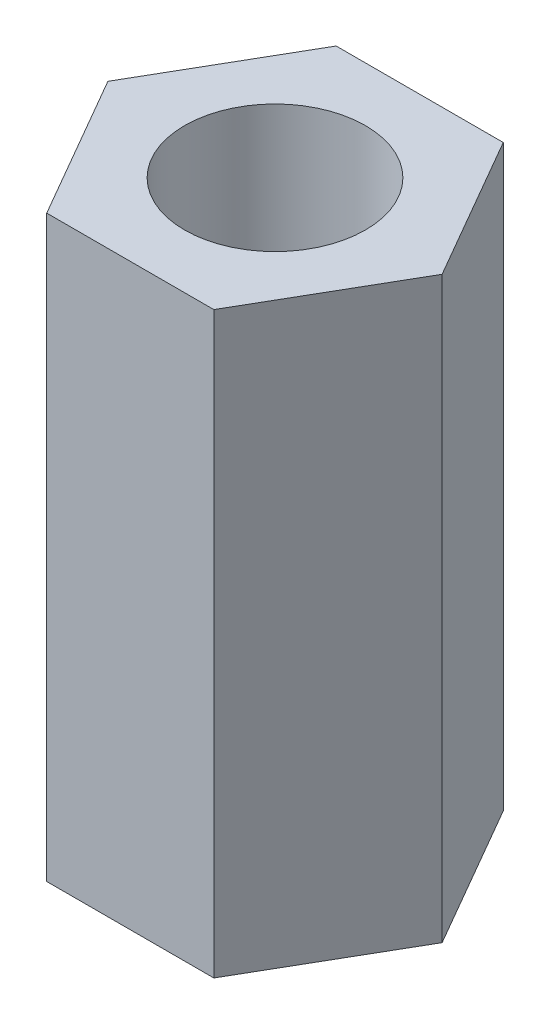
ISO-10303-21;
HEADER;
FILE_DESCRIPTION(('STEP AP214'),'2;1');
FILE_NAME('part.step','',(''),(''),'','','');
FILE_SCHEMA(('AUTOMOTIVE_DESIGN { 1 0 10303 214 1 1 1 1 }'));
ENDSEC;
DATA;
#1=APPLICATION_CONTEXT('core data for automotive mechanical design processes');
#2=APPLICATION_PROTOCOL_DEFINITION('international standard','automotive_design',2000,#1);
#3=PRODUCT_CONTEXT('',#1,'mechanical');
#4=PRODUCT('Part','Part','',(#3));
#5=PRODUCT_RELATED_PRODUCT_CATEGORY('part','',(#4));
#6=PRODUCT_DEFINITION_FORMATION('','',#4);
#7=PRODUCT_DEFINITION_CONTEXT('part definition',#1,'design');
#8=PRODUCT_DEFINITION('design','',#6,#7);
#9=PRODUCT_DEFINITION_SHAPE('','',#8);
#10=(LENGTH_UNIT() NAMED_UNIT(*) SI_UNIT(.MILLI.,.METRE.));
#11=(NAMED_UNIT(*) PLANE_ANGLE_UNIT() SI_UNIT($,.RADIAN.));
#12=(NAMED_UNIT(*) SI_UNIT($,.STERADIAN.) SOLID_ANGLE_UNIT());
#13=UNCERTAINTY_MEASURE_WITH_UNIT(LENGTH_MEASURE(1.E-05),#10,'distance_accuracy_value','');
#14=(GEOMETRIC_REPRESENTATION_CONTEXT(3) GLOBAL_UNCERTAINTY_ASSIGNED_CONTEXT((#13)) GLOBAL_UNIT_ASSIGNED_CONTEXT((#10,
#11,#12)) REPRESENTATION_CONTEXT('',''));
#15=CARTESIAN_POINT('',(0.,0.,0.));
#16=DIRECTION('',(0.,0.,1.));
#17=DIRECTION('',(1.,0.,0.));
#18=AXIS2_PLACEMENT_3D('',#15,#16,#17);
#19=CARTESIAN_POINT('',(0.,12.7,0.));
#20=DIRECTION('',(0.,1.,0.));
#21=DIRECTION('',(0.,0.,1.));
#22=AXIS2_PLACEMENT_3D('',#19,#20,#21);
#23=PLANE('',#22);
#24=DIRECTION('',(1.,0.,0.));
#25=VECTOR('',#24,1.);
#26=CARTESIAN_POINT('',(-1.83308710467706,12.7,3.175));
#27=LINE('',#26,#25);
#28=CARTESIAN_POINT('',(-1.83308710467706,12.7,3.175));
#29=VERTEX_POINT('',#28);
#30=CARTESIAN_POINT('',(1.83308710467706,12.7,3.175));
#31=VERTEX_POINT('',#30);
#32=EDGE_CURVE('E129',#29,#31,#27,.T.);
#33=ORIENTED_EDGE('',*,*,#32,.T.);
#34=DIRECTION('',(0.5,0.,-0.866025403784439));
#35=VECTOR('',#34,1.);
#36=CARTESIAN_POINT('',(1.83308710467706,12.7,3.175));
#37=LINE('',#36,#35);
#38=CARTESIAN_POINT('',(3.66617420935412,12.7,0.));
#39=VERTEX_POINT('',#38);
#40=EDGE_CURVE('E87',#31,#39,#37,.T.);
#41=ORIENTED_EDGE('',*,*,#40,.T.);
#42=DIRECTION('',(-0.5,0.,-0.866025403784439));
#43=VECTOR('',#42,1.);
#44=CARTESIAN_POINT('',(3.66617420935412,12.7,0.));
#45=LINE('',#44,#43);
#46=CARTESIAN_POINT('',(1.83308710467706,12.7,-3.175));
#47=VERTEX_POINT('',#46);
#48=EDGE_CURVE('E100',#39,#47,#45,.T.);
#49=ORIENTED_EDGE('',*,*,#48,.T.);
#50=DIRECTION('',(-1.,0.,0.));
#51=VECTOR('',#50,1.);
#52=CARTESIAN_POINT('',(1.83308710467706,12.7,-3.175));
#53=LINE('',#52,#51);
#54=CARTESIAN_POINT('',(-1.83308710467706,12.7,-3.175));
#55=VERTEX_POINT('',#54);
#56=EDGE_CURVE('E94',#47,#55,#53,.T.);
#57=ORIENTED_EDGE('',*,*,#56,.T.);
#58=DIRECTION('',(-0.5,0.,0.866025403784439));
#59=VECTOR('',#58,1.);
#60=CARTESIAN_POINT('',(-1.83308710467706,12.7,-3.175));
#61=LINE('',#60,#59);
#62=CARTESIAN_POINT('',(-3.66617420935412,12.7,0.));
#63=VERTEX_POINT('',#62);
#64=EDGE_CURVE('E98',#55,#63,#61,.T.);
#65=ORIENTED_EDGE('',*,*,#64,.T.);
#66=DIRECTION('',(0.5,0.,0.866025403784439));
#67=VECTOR('',#66,1.);
#68=CARTESIAN_POINT('',(-3.66617420935412,12.7,0.));
#69=LINE('',#68,#67);
#70=EDGE_CURVE('E50',#63,#29,#69,.T.);
#71=ORIENTED_EDGE('',*,*,#70,.T.);
#72=EDGE_LOOP('',(#33,#41,#49,#57,#65,#71));
#73=FACE_BOUND('',#72,.T.);
#74=CARTESIAN_POINT('',(0.,12.7,0.));
#75=DIRECTION('',(0.,1.,0.));
#76=DIRECTION('',(0.,0.,1.));
#77=AXIS2_PLACEMENT_3D('',#74,#75,#76);
#78=CIRCLE('',#77,1.984375);
#79=CARTESIAN_POINT('',(0.,12.7,1.984375));
#80=VERTEX_POINT('',#79);
#81=EDGE_CURVE('E122',#80,#80,#78,.T.);
#82=ORIENTED_EDGE('',*,*,#81,.F.);
#83=EDGE_LOOP('',(#82));
#84=FACE_BOUND('',#83,.T.);
#85=ADVANCED_FACE('F33',(#73,#84),#23,.T.);
#86=CARTESIAN_POINT('',(0.,0.,0.));
#87=DIRECTION('',(0.,1.,0.));
#88=DIRECTION('',(0.,0.,1.));
#89=AXIS2_PLACEMENT_3D('',#86,#87,#88);
#90=PLANE('',#89);
#91=DIRECTION('',(1.,0.,0.));
#92=VECTOR('',#91,1.);
#93=CARTESIAN_POINT('',(-1.83308710467706,0.,3.175));
#94=LINE('',#93,#92);
#95=CARTESIAN_POINT('',(-1.83308710467706,0.,3.175));
#96=VERTEX_POINT('',#95);
#97=CARTESIAN_POINT('',(1.83308710467706,0.,3.175));
#98=VERTEX_POINT('',#97);
#99=EDGE_CURVE('E118',#96,#98,#94,.T.);
#100=ORIENTED_EDGE('',*,*,#99,.F.);
#101=DIRECTION('',(0.5,0.,0.866025403784439));
#102=VECTOR('',#101,1.);
#103=CARTESIAN_POINT('',(-3.66617420935412,0.,0.));
#104=LINE('',#103,#102);
#105=CARTESIAN_POINT('',(-3.66617420935412,0.,0.));
#106=VERTEX_POINT('',#105);
#107=EDGE_CURVE('E79',#106,#96,#104,.T.);
#108=ORIENTED_EDGE('',*,*,#107,.F.);
#109=DIRECTION('',(-0.5,0.,0.866025403784439));
#110=VECTOR('',#109,1.);
#111=CARTESIAN_POINT('',(-1.83308710467706,0.,-3.175));
#112=LINE('',#111,#110);
#113=CARTESIAN_POINT('',(-1.83308710467706,0.,-3.175));
#114=VERTEX_POINT('',#113);
#115=EDGE_CURVE('E73',#114,#106,#112,.T.);
#116=ORIENTED_EDGE('',*,*,#115,.F.);
#117=DIRECTION('',(-1.,0.,0.));
#118=VECTOR('',#117,1.);
#119=CARTESIAN_POINT('',(1.83308710467706,0.,-3.175));
#120=LINE('',#119,#118);
#121=CARTESIAN_POINT('',(1.83308710467706,0.,-3.175));
#122=VERTEX_POINT('',#121);
#123=EDGE_CURVE('E108',#122,#114,#120,.T.);
#124=ORIENTED_EDGE('',*,*,#123,.F.);
#125=DIRECTION('',(-0.5,0.,-0.866025403784439));
#126=VECTOR('',#125,1.);
#127=CARTESIAN_POINT('',(3.66617420935412,0.,0.));
#128=LINE('',#127,#126);
#129=CARTESIAN_POINT('',(3.66617420935412,0.,0.));
#130=VERTEX_POINT('',#129);
#131=EDGE_CURVE('E124',#130,#122,#128,.T.);
#132=ORIENTED_EDGE('',*,*,#131,.F.);
#133=DIRECTION('',(0.5,0.,-0.866025403784439));
#134=VECTOR('',#133,1.);
#135=CARTESIAN_POINT('',(1.83308710467706,0.,3.175));
#136=LINE('',#135,#134);
#137=EDGE_CURVE('E121',#98,#130,#136,.T.);
#138=ORIENTED_EDGE('',*,*,#137,.F.);
#139=EDGE_LOOP('',(#100,#108,#116,#124,#132,#138));
#140=FACE_BOUND('',#139,.T.);
#141=CARTESIAN_POINT('',(0.,0.,0.));
#142=DIRECTION('',(0.,1.,0.));
#143=DIRECTION('',(0.,0.,1.));
#144=AXIS2_PLACEMENT_3D('',#141,#142,#143);
#145=CIRCLE('',#144,1.984375);
#146=CARTESIAN_POINT('',(0.,0.,1.984375));
#147=VERTEX_POINT('',#146);
#148=EDGE_CURVE('E222',#147,#147,#145,.T.);
#149=ORIENTED_EDGE('',*,*,#148,.T.);
#150=EDGE_LOOP('',(#149));
#151=FACE_BOUND('',#150,.T.);
#152=ADVANCED_FACE('F138',(#140,#151),#90,.F.);
#153=CARTESIAN_POINT('',(-1.83308710467706,12.7,3.175));
#154=DIRECTION('',(0.,0.,-1.));
#155=DIRECTION('',(-1.,0.,0.));
#156=AXIS2_PLACEMENT_3D('',#153,#154,#155);
#157=PLANE('',#156);
#158=ORIENTED_EDGE('',*,*,#99,.T.);
#159=DIRECTION('',(0.,-1.,0.));
#160=VECTOR('',#159,1.);
#161=CARTESIAN_POINT('',(1.83308710467706,12.7,3.175));
#162=LINE('',#161,#160);
#163=EDGE_CURVE('E11',#31,#98,#162,.T.);
#164=ORIENTED_EDGE('',*,*,#163,.F.);
#165=ORIENTED_EDGE('',*,*,#32,.F.);
#166=DIRECTION('',(0.,-1.,0.));
#167=VECTOR('',#166,1.);
#168=CARTESIAN_POINT('',(-1.83308710467706,12.7,3.175));
#169=LINE('',#168,#167);
#170=EDGE_CURVE('E114',#29,#96,#169,.T.);
#171=ORIENTED_EDGE('',*,*,#170,.T.);
#172=EDGE_LOOP('',(#158,#164,#165,#171));
#173=FACE_BOUND('',#172,.T.);
#174=ADVANCED_FACE('F35',(#173),#157,.F.);
#175=CARTESIAN_POINT('',(1.83308710467706,12.7,3.175));
#176=DIRECTION('',(-0.866025403784439,0.,-0.5));
#177=DIRECTION('',(-0.5,0.,0.866025403784439));
#178=AXIS2_PLACEMENT_3D('',#175,#176,#177);
#179=PLANE('',#178);
#180=ORIENTED_EDGE('',*,*,#137,.T.);
#181=DIRECTION('',(0.,-1.,0.));
#182=VECTOR('',#181,1.);
#183=CARTESIAN_POINT('',(3.66617420935412,12.7,0.));
#184=LINE('',#183,#182);
#185=EDGE_CURVE('E42',#39,#130,#184,.T.);
#186=ORIENTED_EDGE('',*,*,#185,.F.);
#187=ORIENTED_EDGE('',*,*,#40,.F.);
#188=ORIENTED_EDGE('',*,*,#163,.T.);
#189=EDGE_LOOP('',(#180,#186,#187,#188));
#190=FACE_BOUND('',#189,.T.);
#191=ADVANCED_FACE('F163',(#190),#179,.F.);
#192=CARTESIAN_POINT('',(3.66617420935412,12.7,0.));
#193=DIRECTION('',(-0.866025403784439,0.,0.5));
#194=DIRECTION('',(0.5,0.,0.866025403784439));
#195=AXIS2_PLACEMENT_3D('',#192,#193,#194);
#196=PLANE('',#195);
#197=ORIENTED_EDGE('',*,*,#131,.T.);
#198=DIRECTION('',(0.,-1.,0.));
#199=VECTOR('',#198,1.);
#200=CARTESIAN_POINT('',(1.83308710467706,12.7,-3.175));
#201=LINE('',#200,#199);
#202=EDGE_CURVE('E109',#47,#122,#201,.T.);
#203=ORIENTED_EDGE('',*,*,#202,.F.);
#204=ORIENTED_EDGE('',*,*,#48,.F.);
#205=ORIENTED_EDGE('',*,*,#185,.T.);
#206=EDGE_LOOP('',(#197,#203,#204,#205));
#207=FACE_BOUND('',#206,.T.);
#208=ADVANCED_FACE('F135',(#207),#196,.F.);
#209=CARTESIAN_POINT('',(1.83308710467706,12.7,-3.175));
#210=DIRECTION('',(0.,0.,1.));
#211=DIRECTION('',(1.,0.,0.));
#212=AXIS2_PLACEMENT_3D('',#209,#210,#211);
#213=PLANE('',#212);
#214=ORIENTED_EDGE('',*,*,#123,.T.);
#215=DIRECTION('',(0.,-1.,0.));
#216=VECTOR('',#215,1.);
#217=CARTESIAN_POINT('',(-1.83308710467706,12.7,-3.175));
#218=LINE('',#217,#216);
#219=EDGE_CURVE('E105',#55,#114,#218,.T.);
#220=ORIENTED_EDGE('',*,*,#219,.F.);
#221=ORIENTED_EDGE('',*,*,#56,.F.);
#222=ORIENTED_EDGE('',*,*,#202,.T.);
#223=EDGE_LOOP('',(#214,#220,#221,#222));
#224=FACE_BOUND('',#223,.T.);
#225=ADVANCED_FACE('F106',(#224),#213,.F.);
#226=CARTESIAN_POINT('',(-1.83308710467706,12.7,-3.175));
#227=DIRECTION('',(0.866025403784439,0.,0.5));
#228=DIRECTION('',(0.5,0.,-0.866025403784439));
#229=AXIS2_PLACEMENT_3D('',#226,#227,#228);
#230=PLANE('',#229);
#231=ORIENTED_EDGE('',*,*,#115,.T.);
#232=DIRECTION('',(0.,-1.,0.));
#233=VECTOR('',#232,1.);
#234=CARTESIAN_POINT('',(-3.66617420935412,12.7,0.));
#235=LINE('',#234,#233);
#236=EDGE_CURVE('E110',#63,#106,#235,.T.);
#237=ORIENTED_EDGE('',*,*,#236,.F.);
#238=ORIENTED_EDGE('',*,*,#64,.F.);
#239=ORIENTED_EDGE('',*,*,#219,.T.);
#240=EDGE_LOOP('',(#231,#237,#238,#239));
#241=FACE_BOUND('',#240,.T.);
#242=ADVANCED_FACE('F112',(#241),#230,.F.);
#243=CARTESIAN_POINT('',(-3.66617420935412,12.7,0.));
#244=DIRECTION('',(0.866025403784439,0.,-0.5));
#245=DIRECTION('',(-0.5,0.,-0.866025403784439));
#246=AXIS2_PLACEMENT_3D('',#243,#244,#245);
#247=PLANE('',#246);
#248=ORIENTED_EDGE('',*,*,#107,.T.);
#249=ORIENTED_EDGE('',*,*,#170,.F.);
#250=ORIENTED_EDGE('',*,*,#70,.F.);
#251=ORIENTED_EDGE('',*,*,#236,.T.);
#252=EDGE_LOOP('',(#248,#249,#250,#251));
#253=FACE_BOUND('',#252,.T.);
#254=ADVANCED_FACE('F143',(#253),#247,.F.);
#255=CARTESIAN_POINT('',(0.,12.7,0.));
#256=DIRECTION('',(0.,-1.,0.));
#257=DIRECTION('',(0.,0.,-1.));
#258=AXIS2_PLACEMENT_3D('',#255,#256,#257);
#259=CYLINDRICAL_SURFACE('',#258,1.984375);
#260=ORIENTED_EDGE('',*,*,#81,.T.);
#261=EDGE_LOOP('',(#260));
#262=FACE_BOUND('',#261,.T.);
#263=ORIENTED_EDGE('',*,*,#148,.F.);
#264=EDGE_LOOP('',(#263));
#265=FACE_BOUND('',#264,.T.);
#266=ADVANCED_FACE('F145',(#262,#265),#259,.F.);
#267=CLOSED_SHELL('',(#85,#152,#174,#191,#208,#225,#242,#254,#266));
#268=MANIFOLD_SOLID_BREP('B2',#267);
#269=ADVANCED_BREP_SHAPE_REPRESENTATION('',(#18,#268),#14);
#270=SHAPE_DEFINITION_REPRESENTATION(#9,#269);
ENDSEC;
END-ISO-10303-21;
